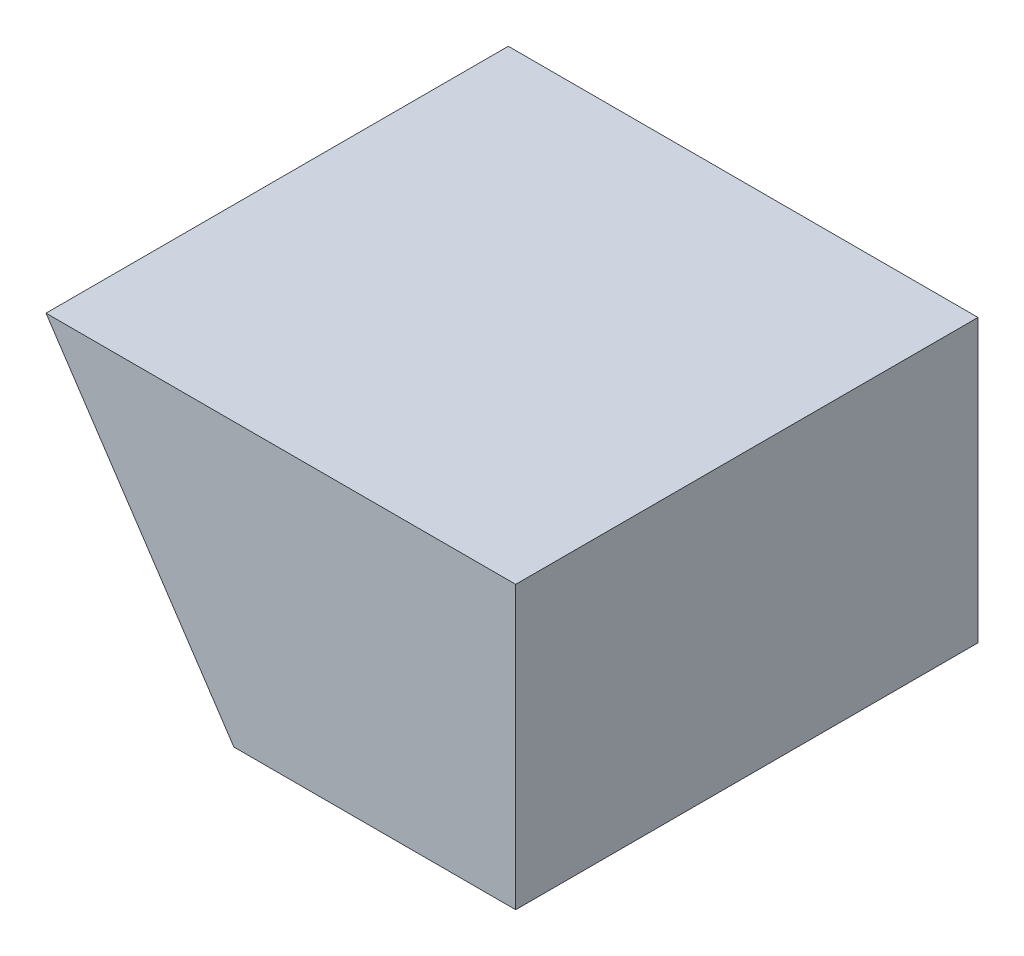
ISO-10303-21;
HEADER;
FILE_DESCRIPTION(('STEP AP214'),'2;1');
FILE_NAME('part.step','',(''),(''),'','','');
FILE_SCHEMA(('AUTOMOTIVE_DESIGN { 1 0 10303 214 1 1 1 1 }'));
ENDSEC;
DATA;
#1=APPLICATION_CONTEXT('core data for automotive mechanical design processes');
#2=APPLICATION_PROTOCOL_DEFINITION('international standard','automotive_design',2000,#1);
#3=PRODUCT_CONTEXT('',#1,'mechanical');
#4=PRODUCT('Part','Part','',(#3));
#5=PRODUCT_RELATED_PRODUCT_CATEGORY('part','',(#4));
#6=PRODUCT_DEFINITION_FORMATION('','',#4);
#7=PRODUCT_DEFINITION_CONTEXT('part definition',#1,'design');
#8=PRODUCT_DEFINITION('design','',#6,#7);
#9=PRODUCT_DEFINITION_SHAPE('','',#8);
#10=(LENGTH_UNIT() NAMED_UNIT(*) SI_UNIT(.MILLI.,.METRE.));
#11=(NAMED_UNIT(*) PLANE_ANGLE_UNIT() SI_UNIT($,.RADIAN.));
#12=(NAMED_UNIT(*) SI_UNIT($,.STERADIAN.) SOLID_ANGLE_UNIT());
#13=UNCERTAINTY_MEASURE_WITH_UNIT(LENGTH_MEASURE(1.E-05),#10,'distance_accuracy_value','');
#14=(GEOMETRIC_REPRESENTATION_CONTEXT(3) GLOBAL_UNCERTAINTY_ASSIGNED_CONTEXT((#13)) GLOBAL_UNIT_ASSIGNED_CONTEXT((#10,
#11,#12)) REPRESENTATION_CONTEXT('',''));
#15=CARTESIAN_POINT('',(0.,0.,0.));
#16=DIRECTION('',(0.,0.,1.));
#17=DIRECTION('',(1.,0.,0.));
#18=AXIS2_PLACEMENT_3D('',#15,#16,#17);
#19=CARTESIAN_POINT('',(-21.1015384615384,-14.0676923076923,25.));
#20=DIRECTION('',(-0.832050294337843,-0.554700196225229,0.));
#21=DIRECTION('',(0.554700196225229,-0.832050294337844,0.));
#22=AXIS2_PLACEMENT_3D('',#19,#20,#21);
#23=PLANE('',#22);
#24=DIRECTION('',(-0.554700196225229,0.832050294337844,0.));
#25=VECTOR('',#24,1.);
#26=CARTESIAN_POINT('',(-21.1015384615384,-14.0676923076923,-25.));
#27=LINE('',#26,#25);
#28=CARTESIAN_POINT('',(-30.48,0.,-25.));
#29=VERTEX_POINT('',#28);
#30=CARTESIAN_POINT('',(-50.8,30.48,-25.));
#31=VERTEX_POINT('',#30);
#32=EDGE_CURVE('E130',#29,#31,#27,.T.);
#33=ORIENTED_EDGE('',*,*,#32,.F.);
#34=DIRECTION('',(0.,0.,-1.));
#35=VECTOR('',#34,1.);
#36=CARTESIAN_POINT('',(-30.48,0.,25.));
#37=LINE('',#36,#35);
#38=CARTESIAN_POINT('',(-30.48,0.,25.));
#39=VERTEX_POINT('',#38);
#40=EDGE_CURVE('E49',#39,#29,#37,.T.);
#41=ORIENTED_EDGE('',*,*,#40,.F.);
#42=DIRECTION('',(-0.554700196225229,0.832050294337844,0.));
#43=VECTOR('',#42,1.);
#44=CARTESIAN_POINT('',(-21.1015384615384,-14.0676923076923,25.));
#45=LINE('',#44,#43);
#46=CARTESIAN_POINT('',(-50.8,30.48,25.));
#47=VERTEX_POINT('',#46);
#48=EDGE_CURVE('E120',#39,#47,#45,.T.);
#49=ORIENTED_EDGE('',*,*,#48,.T.);
#50=DIRECTION('',(0.,0.,-1.));
#51=VECTOR('',#50,1.);
#52=CARTESIAN_POINT('',(-50.8,30.48,25.));
#53=LINE('',#52,#51);
#54=EDGE_CURVE('E11',#47,#31,#53,.T.);
#55=ORIENTED_EDGE('',*,*,#54,.T.);
#56=EDGE_LOOP('',(#33,#41,#49,#55));
#57=FACE_BOUND('',#56,.T.);
#58=DIRECTION('',(0.,0.,1.));
#59=VECTOR('',#58,1.);
#60=CARTESIAN_POINT('',(-31.2498558932576,1.15478383988646,-5.));
#61=LINE('',#60,#59);
#62=CARTESIAN_POINT('',(-31.2498558932576,1.15478383988646,-5.));
#63=VERTEX_POINT('',#62);
#64=CARTESIAN_POINT('',(-31.2498558932576,1.15478383988647,5.));
#65=VERTEX_POINT('',#64);
#66=EDGE_CURVE('E108',#63,#65,#61,.T.);
#67=ORIENTED_EDGE('',*,*,#66,.F.);
#68=DIRECTION('',(-0.554700196225229,0.832050294337844,0.));
#69=VECTOR('',#68,1.);
#70=CARTESIAN_POINT('',(-21.1015384615384,-14.0676923076923,-5.));
#71=LINE('',#70,#69);
#72=CARTESIAN_POINT('',(-34.3993748759731,5.87906231395969,-5.));
#73=VERTEX_POINT('',#72);
#74=EDGE_CURVE('E98',#63,#73,#71,.T.);
#75=ORIENTED_EDGE('',*,*,#74,.T.);
#76=DIRECTION('',(0.,0.,1.));
#77=VECTOR('',#76,1.);
#78=CARTESIAN_POINT('',(-34.3993748759731,5.87906231395969,-5.));
#79=LINE('',#78,#77);
#80=CARTESIAN_POINT('',(-34.3993748759731,5.87906231395969,5.));
#81=VERTEX_POINT('',#80);
#82=EDGE_CURVE('E110',#73,#81,#79,.T.);
#83=ORIENTED_EDGE('',*,*,#82,.T.);
#84=DIRECTION('',(-0.554700196225229,0.832050294337844,0.));
#85=VECTOR('',#84,1.);
#86=CARTESIAN_POINT('',(-21.1015384615384,-14.0676923076923,5.));
#87=LINE('',#86,#85);
#88=EDGE_CURVE('E112',#65,#81,#87,.T.);
#89=ORIENTED_EDGE('',*,*,#88,.F.);
#90=EDGE_LOOP('',(#67,#75,#83,#89));
#91=FACE_BOUND('',#90,.T.);
#92=ADVANCED_FACE('F41',(#57,#91),#23,.T.);
#93=CARTESIAN_POINT('',(0.,30.48,25.));
#94=DIRECTION('',(0.,1.,0.));
#95=DIRECTION('',(-1.,0.,0.));
#96=AXIS2_PLACEMENT_3D('',#93,#94,#95);
#97=PLANE('',#96);
#98=DIRECTION('',(1.,0.,0.));
#99=VECTOR('',#98,1.);
#100=CARTESIAN_POINT('',(0.,30.48,-25.));
#101=LINE('',#100,#99);
#102=CARTESIAN_POINT('',(0.,30.48,-25.));
#103=VERTEX_POINT('',#102);
#104=EDGE_CURVE('E114',#31,#103,#101,.T.);
#105=ORIENTED_EDGE('',*,*,#104,.F.);
#106=ORIENTED_EDGE('',*,*,#54,.F.);
#107=DIRECTION('',(1.,0.,0.));
#108=VECTOR('',#107,1.);
#109=CARTESIAN_POINT('',(0.,30.48,25.));
#110=LINE('',#109,#108);
#111=CARTESIAN_POINT('',(0.,30.48,25.));
#112=VERTEX_POINT('',#111);
#113=EDGE_CURVE('E118',#47,#112,#110,.T.);
#114=ORIENTED_EDGE('',*,*,#113,.T.);
#115=DIRECTION('',(0.,0.,-1.));
#116=VECTOR('',#115,1.);
#117=CARTESIAN_POINT('',(0.,30.48,25.));
#118=LINE('',#117,#116);
#119=EDGE_CURVE('E64',#112,#103,#118,.T.);
#120=ORIENTED_EDGE('',*,*,#119,.T.);
#121=EDGE_LOOP('',(#105,#106,#114,#120));
#122=FACE_BOUND('',#121,.T.);
#123=ADVANCED_FACE('F43',(#122),#97,.T.);
#124=CARTESIAN_POINT('',(0.,0.,25.));
#125=DIRECTION('',(0.,-1.,0.));
#126=DIRECTION('',(1.,0.,0.));
#127=AXIS2_PLACEMENT_3D('',#124,#125,#126);
#128=PLANE('',#127);
#129=DIRECTION('',(-1.,0.,0.));
#130=VECTOR('',#129,1.);
#131=CARTESIAN_POINT('',(0.,0.,-25.));
#132=LINE('',#131,#130);
#133=CARTESIAN_POINT('',(0.,0.,-25.));
#134=VERTEX_POINT('',#133);
#135=EDGE_CURVE('E133',#134,#29,#132,.T.);
#136=ORIENTED_EDGE('',*,*,#135,.F.);
#137=DIRECTION('',(0.,0.,-1.));
#138=VECTOR('',#137,1.);
#139=CARTESIAN_POINT('',(0.,0.,25.));
#140=LINE('',#139,#138);
#141=CARTESIAN_POINT('',(0.,0.,25.));
#142=VERTEX_POINT('',#141);
#143=EDGE_CURVE('E139',#142,#134,#140,.T.);
#144=ORIENTED_EDGE('',*,*,#143,.F.);
#145=DIRECTION('',(-1.,0.,0.));
#146=VECTOR('',#145,1.);
#147=CARTESIAN_POINT('',(0.,0.,25.));
#148=LINE('',#147,#146);
#149=EDGE_CURVE('E124',#142,#39,#148,.T.);
#150=ORIENTED_EDGE('',*,*,#149,.T.);
#151=ORIENTED_EDGE('',*,*,#40,.T.);
#152=EDGE_LOOP('',(#136,#144,#150,#151));
#153=FACE_BOUND('',#152,.T.);
#154=ADVANCED_FACE('F143',(#153),#128,.T.);
#155=CARTESIAN_POINT('',(0.,0.,25.));
#156=DIRECTION('',(1.,0.,0.));
#157=DIRECTION('',(0.,1.,0.));
#158=AXIS2_PLACEMENT_3D('',#155,#156,#157);
#159=PLANE('',#158);
#160=DIRECTION('',(0.,-1.,0.));
#161=VECTOR('',#160,1.);
#162=CARTESIAN_POINT('',(0.,0.,-25.));
#163=LINE('',#162,#161);
#164=EDGE_CURVE('E121',#103,#134,#163,.T.);
#165=ORIENTED_EDGE('',*,*,#164,.F.);
#166=ORIENTED_EDGE('',*,*,#119,.F.);
#167=DIRECTION('',(0.,-1.,0.));
#168=VECTOR('',#167,1.);
#169=CARTESIAN_POINT('',(0.,0.,25.));
#170=LINE('',#169,#168);
#171=EDGE_CURVE('E127',#112,#142,#170,.T.);
#172=ORIENTED_EDGE('',*,*,#171,.T.);
#173=ORIENTED_EDGE('',*,*,#143,.T.);
#174=EDGE_LOOP('',(#165,#166,#172,#173));
#175=FACE_BOUND('',#174,.T.);
#176=ADVANCED_FACE('F149',(#175),#159,.T.);
#177=CARTESIAN_POINT('',(0.,0.,25.));
#178=DIRECTION('',(0.,0.,1.));
#179=DIRECTION('',(1.,0.,0.));
#180=AXIS2_PLACEMENT_3D('',#177,#178,#179);
#181=PLANE('',#180);
#182=ORIENTED_EDGE('',*,*,#113,.F.);
#183=ORIENTED_EDGE('',*,*,#48,.F.);
#184=ORIENTED_EDGE('',*,*,#149,.F.);
#185=ORIENTED_EDGE('',*,*,#171,.F.);
#186=EDGE_LOOP('',(#182,#183,#184,#185));
#187=FACE_BOUND('',#186,.T.);
#188=ADVANCED_FACE('F152',(#187),#181,.T.);
#189=CARTESIAN_POINT('',(0.,0.,-25.));
#190=DIRECTION('',(0.,0.,1.));
#191=DIRECTION('',(1.,0.,0.));
#192=AXIS2_PLACEMENT_3D('',#189,#190,#191);
#193=PLANE('',#192);
#194=ORIENTED_EDGE('',*,*,#104,.T.);
#195=ORIENTED_EDGE('',*,*,#164,.T.);
#196=ORIENTED_EDGE('',*,*,#135,.T.);
#197=ORIENTED_EDGE('',*,*,#32,.T.);
#198=EDGE_LOOP('',(#194,#195,#196,#197));
#199=FACE_BOUND('',#198,.T.);
#200=ADVANCED_FACE('F148',(#199),#193,.F.);
#201=CARTESIAN_POINT('',(-30.48,5.08,-5.));
#202=DIRECTION('',(0.,0.,1.));
#203=DIRECTION('',(1.,0.,0.));
#204=AXIS2_PLACEMENT_3D('',#201,#202,#203);
#205=CYLINDRICAL_SURFACE('',#204,4.);
#206=CARTESIAN_POINT('',(-30.48,5.08,5.));
#207=DIRECTION('',(0.,0.,1.));
#208=DIRECTION('',(1.,0.,0.));
#209=AXIS2_PLACEMENT_3D('',#206,#207,#208);
#210=CIRCLE('',#209,4.);
#211=EDGE_CURVE('E55',#65,#81,#210,.T.);
#212=ORIENTED_EDGE('',*,*,#211,.T.);
#213=ORIENTED_EDGE('',*,*,#82,.F.);
#214=CARTESIAN_POINT('',(-30.48,5.08,-5.));
#215=DIRECTION('',(0.,0.,1.));
#216=DIRECTION('',(1.,0.,0.));
#217=AXIS2_PLACEMENT_3D('',#214,#215,#216);
#218=CIRCLE('',#217,4.);
#219=EDGE_CURVE('E101',#63,#73,#218,.T.);
#220=ORIENTED_EDGE('',*,*,#219,.F.);
#221=ORIENTED_EDGE('',*,*,#66,.T.);
#222=EDGE_LOOP('',(#212,#213,#220,#221));
#223=FACE_BOUND('',#222,.T.);
#224=ADVANCED_FACE('F107',(#223),#205,.F.);
#225=CARTESIAN_POINT('',(0.,0.,-5.));
#226=DIRECTION('',(0.,0.,1.));
#227=DIRECTION('',(1.,0.,0.));
#228=AXIS2_PLACEMENT_3D('',#225,#226,#227);
#229=PLANE('',#228);
#230=ORIENTED_EDGE('',*,*,#74,.F.);
#231=ORIENTED_EDGE('',*,*,#219,.T.);
#232=EDGE_LOOP('',(#230,#231));
#233=FACE_BOUND('',#232,.T.);
#234=ADVANCED_FACE('F100',(#233),#229,.T.);
#235=CARTESIAN_POINT('',(0.,0.,5.));
#236=DIRECTION('',(0.,0.,1.));
#237=DIRECTION('',(1.,0.,0.));
#238=AXIS2_PLACEMENT_3D('',#235,#236,#237);
#239=PLANE('',#238);
#240=ORIENTED_EDGE('',*,*,#88,.T.);
#241=ORIENTED_EDGE('',*,*,#211,.F.);
#242=EDGE_LOOP('',(#240,#241));
#243=FACE_BOUND('',#242,.T.);
#244=ADVANCED_FACE('F170',(#243),#239,.F.);
#245=CLOSED_SHELL('',(#92,#123,#154,#176,#188,#200,#224,#234,#244));
#246=MANIFOLD_SOLID_BREP('B2',#245);
#247=ADVANCED_BREP_SHAPE_REPRESENTATION('',(#18,#246),#14);
#248=SHAPE_DEFINITION_REPRESENTATION(#9,#247);
ENDSEC;
END-ISO-10303-21;
